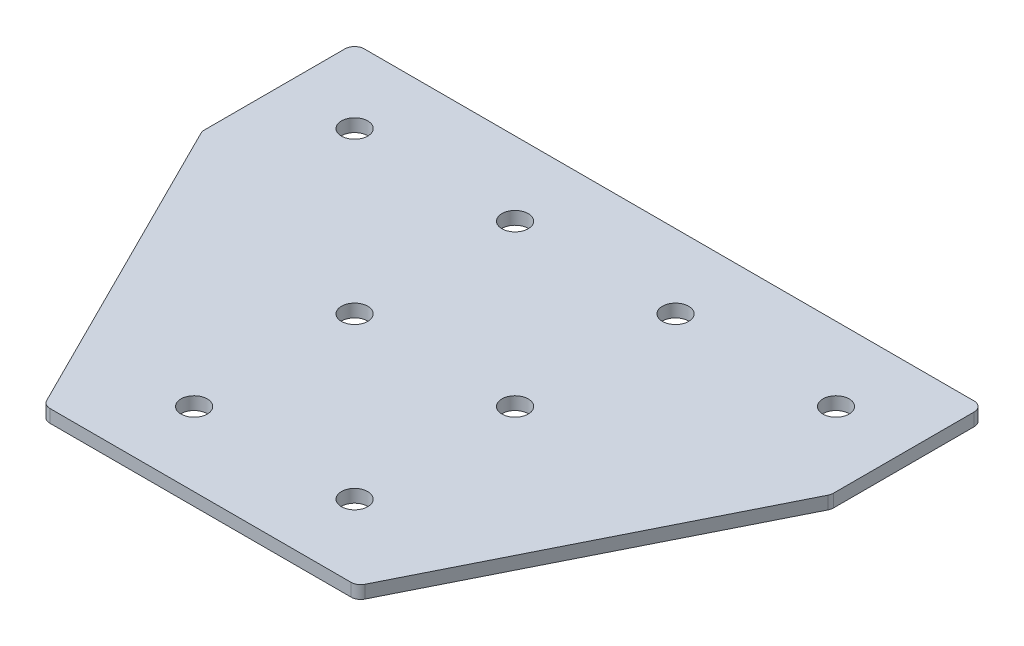
ISO-10303-21;
HEADER;
FILE_DESCRIPTION(('STEP AP214'),'2;1');
FILE_NAME('part.step','',(''),(''),'','','');
FILE_SCHEMA(('AUTOMOTIVE_DESIGN { 1 0 10303 214 1 1 1 1 }'));
ENDSEC;
DATA;
#1=APPLICATION_CONTEXT('core data for automotive mechanical design processes');
#2=APPLICATION_PROTOCOL_DEFINITION('international standard','automotive_design',2000,#1);
#3=PRODUCT_CONTEXT('',#1,'mechanical');
#4=PRODUCT('Part','Part','',(#3));
#5=PRODUCT_RELATED_PRODUCT_CATEGORY('part','',(#4));
#6=PRODUCT_DEFINITION_FORMATION('','',#4);
#7=PRODUCT_DEFINITION_CONTEXT('part definition',#1,'design');
#8=PRODUCT_DEFINITION('design','',#6,#7);
#9=PRODUCT_DEFINITION_SHAPE('','',#8);
#10=(LENGTH_UNIT() NAMED_UNIT(*) SI_UNIT(.MILLI.,.METRE.));
#11=(NAMED_UNIT(*) PLANE_ANGLE_UNIT() SI_UNIT($,.RADIAN.));
#12=(NAMED_UNIT(*) SI_UNIT($,.STERADIAN.) SOLID_ANGLE_UNIT());
#13=UNCERTAINTY_MEASURE_WITH_UNIT(LENGTH_MEASURE(1.E-05),#10,'distance_accuracy_value','');
#14=(GEOMETRIC_REPRESENTATION_CONTEXT(3) GLOBAL_UNCERTAINTY_ASSIGNED_CONTEXT((#13)) GLOBAL_UNIT_ASSIGNED_CONTEXT((#10,
#11,#12)) REPRESENTATION_CONTEXT('',''));
#15=CARTESIAN_POINT('',(0.,0.,0.));
#16=DIRECTION('',(0.,0.,1.));
#17=DIRECTION('',(1.,0.,0.));
#18=AXIS2_PLACEMENT_3D('',#15,#16,#17);
#19=CARTESIAN_POINT('',(-1.20790986693464,-0.158568640349131,-50.6332222330343));
#20=DIRECTION('',(0.,-1.,0.));
#21=DIRECTION('',(0.,0.,-1.));
#22=AXIS2_PLACEMENT_3D('',#19,#20,#21);
#23=PLANE('',#22);
#24=DIRECTION('',(1.,0.,0.));
#25=VECTOR('',#24,1.);
#26=CARTESIAN_POINT('',(-49.2079098669348,-0.158568640349131,72.3667777669657));
#27=LINE('',#26,#25);
#28=CARTESIAN_POINT('',(-48.1177399231852,-0.158568640349131,72.3667777669657));
#29=VERTEX_POINT('',#28);
#30=CARTESIAN_POINT('',(45.701920189316,-0.158568640349131,72.3667777669657));
#31=VERTEX_POINT('',#30);
#32=EDGE_CURVE('E194',#29,#31,#27,.T.);
#33=ORIENTED_EDGE('',*,*,#32,.F.);
#34=CARTESIAN_POINT('',(-48.1177399231852,-0.158568640349131,69.3667777669657));
#35=DIRECTION('',(0.,1.,0.));
#36=DIRECTION('',(0.,0.,-1.));
#37=AXIS2_PLACEMENT_3D('',#34,#35,#36);
#38=CIRCLE('',#37,3.);
#39=CARTESIAN_POINT('',(-50.801021496185,-0.158568640349131,70.7084185534656));
#40=VERTEX_POINT('',#39);
#41=EDGE_CURVE('E154',#40,#29,#38,.T.);
#42=ORIENTED_EDGE('',*,*,#41,.F.);
#43=DIRECTION('',(-0.447213595499957,0.,-0.894427190999917));
#44=VECTOR('',#43,1.);
#45=CARTESIAN_POINT('',(-49.9718418894349,-0.158568640349131,72.3667777669657));
#46=LINE('',#45,#44);
#47=CARTESIAN_POINT('',(-98.8911914399342,-0.158568640349131,-25.4719213340333));
#48=VERTEX_POINT('',#47);
#49=EDGE_CURVE('E141',#40,#48,#46,.T.);
#50=ORIENTED_EDGE('',*,*,#49,.T.);
#51=CARTESIAN_POINT('',(-96.2079098669345,-0.158568640349131,-26.8135621205331));
#52=DIRECTION('',(0.,1.,0.));
#53=DIRECTION('',(0.,0.,-1.));
#54=AXIS2_PLACEMENT_3D('',#51,#52,#53);
#55=CIRCLE('',#54,3.);
#56=CARTESIAN_POINT('',(-99.2079098669345,-0.158568640349131,-26.8135621205331));
#57=VERTEX_POINT('',#56);
#58=EDGE_CURVE('E152',#57,#48,#55,.T.);
#59=ORIENTED_EDGE('',*,*,#58,.F.);
#60=DIRECTION('',(0.,0.,-1.));
#61=VECTOR('',#60,1.);
#62=CARTESIAN_POINT('',(-99.2079098669345,-0.158568640349131,-26.1053581880338));
#63=LINE('',#62,#61);
#64=CARTESIAN_POINT('',(-99.2079098669345,-0.158568640349131,-70.6332222330343));
#65=VERTEX_POINT('',#64);
#66=EDGE_CURVE('E124',#57,#65,#63,.T.);
#67=ORIENTED_EDGE('',*,*,#66,.T.);
#68=CARTESIAN_POINT('',(-96.2079098669345,-0.158568640349131,-70.6332222330343));
#69=DIRECTION('',(0.,1.,0.));
#70=DIRECTION('',(0.,0.,-1.));
#71=AXIS2_PLACEMENT_3D('',#68,#69,#70);
#72=CIRCLE('',#71,3.);
#73=CARTESIAN_POINT('',(-96.2079098669345,-0.158568640349131,-73.6332222330343));
#74=VERTEX_POINT('',#73);
#75=EDGE_CURVE('E149',#74,#65,#72,.T.);
#76=ORIENTED_EDGE('',*,*,#75,.F.);
#77=DIRECTION('',(-1.,0.,0.));
#78=VECTOR('',#77,1.);
#79=CARTESIAN_POINT('',(96.7920901330652,-0.158568640349131,-73.6332222330343));
#80=LINE('',#79,#78);
#81=CARTESIAN_POINT('',(93.7920901330652,-0.158568640349131,-73.6332222330343));
#82=VERTEX_POINT('',#81);
#83=EDGE_CURVE('E191',#82,#74,#80,.T.);
#84=ORIENTED_EDGE('',*,*,#83,.F.);
#85=CARTESIAN_POINT('',(93.7920901330652,-0.158568640349131,-70.6332222330343));
#86=DIRECTION('',(0.,-1.,0.));
#87=DIRECTION('',(0.,0.,-1.));
#88=AXIS2_PLACEMENT_3D('',#85,#86,#87);
#89=CIRCLE('',#88,3.);
#90=CARTESIAN_POINT('',(96.7920901330652,-0.158568640349131,-70.6332222330343));
#91=VERTEX_POINT('',#90);
#92=EDGE_CURVE('E215',#82,#91,#89,.T.);
#93=ORIENTED_EDGE('',*,*,#92,.T.);
#94=DIRECTION('',(0.,0.,-1.));
#95=VECTOR('',#94,1.);
#96=CARTESIAN_POINT('',(96.7920901330652,-0.158568640349131,-26.1053581880338));
#97=LINE('',#96,#95);
#98=CARTESIAN_POINT('',(96.7920901330652,-0.158568640349131,-26.8135621205332));
#99=VERTEX_POINT('',#98);
#100=EDGE_CURVE('E188',#99,#91,#97,.T.);
#101=ORIENTED_EDGE('',*,*,#100,.F.);
#102=CARTESIAN_POINT('',(93.7920901330652,-0.158568640349131,-26.8135621205332));
#103=DIRECTION('',(0.,-1.,0.));
#104=DIRECTION('',(0.,0.,-1.));
#105=AXIS2_PLACEMENT_3D('',#102,#103,#104);
#106=CIRCLE('',#105,3.);
#107=CARTESIAN_POINT('',(96.475371706065,-0.158568640349131,-25.4719213340333));
#108=VERTEX_POINT('',#107);
#109=EDGE_CURVE('E31',#99,#108,#106,.T.);
#110=ORIENTED_EDGE('',*,*,#109,.T.);
#111=DIRECTION('',(0.447213595499956,0.,-0.894427190999917));
#112=VECTOR('',#111,1.);
#113=CARTESIAN_POINT('',(47.5560221555657,-0.158568640349131,72.3667777669657));
#114=LINE('',#113,#112);
#115=CARTESIAN_POINT('',(48.3852017623158,-0.158568640349131,70.7084185534656));
#116=VERTEX_POINT('',#115);
#117=EDGE_CURVE('E196',#116,#108,#114,.T.);
#118=ORIENTED_EDGE('',*,*,#117,.F.);
#119=CARTESIAN_POINT('',(45.701920189316,-0.158568640349131,69.3667777669657));
#120=DIRECTION('',(0.,-1.,0.));
#121=DIRECTION('',(0.,0.,-1.));
#122=AXIS2_PLACEMENT_3D('',#119,#120,#121);
#123=CIRCLE('',#122,3.);
#124=EDGE_CURVE('E218',#116,#31,#123,.T.);
#125=ORIENTED_EDGE('',*,*,#124,.T.);
#126=EDGE_LOOP('',(#33,#42,#50,#59,#67,#76,#84,#93,#101,#110,#118,#125));
#127=FACE_BOUND('',#126,.T.);
#128=CARTESIAN_POINT('',(23.7920901330654,-0.158568640349131,49.3667777669658));
#129=DIRECTION('',(0.,1.,0.));
#130=DIRECTION('',(0.,0.,1.));
#131=AXIS2_PLACEMENT_3D('',#128,#129,#130);
#132=CIRCLE('',#131,4.10000000000001);
#133=CARTESIAN_POINT('',(23.7920901330654,-0.158568640349131,53.4667777669658));
#134=VERTEX_POINT('',#133);
#135=EDGE_CURVE('E164',#134,#134,#132,.T.);
#136=ORIENTED_EDGE('',*,*,#135,.T.);
#137=EDGE_LOOP('',(#136));
#138=FACE_BOUND('',#137,.T.);
#139=CARTESIAN_POINT('',(23.7920901330654,-0.158568640349131,-0.633222233034254));
#140=DIRECTION('',(0.,1.,0.));
#141=DIRECTION('',(0.,0.,1.));
#142=AXIS2_PLACEMENT_3D('',#139,#140,#141);
#143=CIRCLE('',#142,4.1);
#144=CARTESIAN_POINT('',(23.7920901330654,-0.158568640349131,3.46677776696575));
#145=VERTEX_POINT('',#144);
#146=EDGE_CURVE('E170',#145,#145,#143,.T.);
#147=ORIENTED_EDGE('',*,*,#146,.T.);
#148=EDGE_LOOP('',(#147));
#149=FACE_BOUND('',#148,.T.);
#150=CARTESIAN_POINT('',(73.7920901330654,-0.158568640349131,-50.6332222330343));
#151=DIRECTION('',(0.,1.,0.));
#152=DIRECTION('',(0.,0.,1.));
#153=AXIS2_PLACEMENT_3D('',#150,#151,#152);
#154=CIRCLE('',#153,4.09999999999999);
#155=CARTESIAN_POINT('',(73.7920901330654,-0.158568640349131,-46.5332222330343));
#156=VERTEX_POINT('',#155);
#157=EDGE_CURVE('E176',#156,#156,#154,.T.);
#158=ORIENTED_EDGE('',*,*,#157,.T.);
#159=EDGE_LOOP('',(#158));
#160=FACE_BOUND('',#159,.T.);
#161=CARTESIAN_POINT('',(23.7920901330654,-0.158568640349131,-50.6332222330343));
#162=DIRECTION('',(0.,1.,0.));
#163=DIRECTION('',(0.,0.,1.));
#164=AXIS2_PLACEMENT_3D('',#161,#162,#163);
#165=CIRCLE('',#164,4.1);
#166=CARTESIAN_POINT('',(23.7920901330654,-0.158568640349131,-46.5332222330343));
#167=VERTEX_POINT('',#166);
#168=EDGE_CURVE('E182',#167,#167,#165,.T.);
#169=ORIENTED_EDGE('',*,*,#168,.T.);
#170=EDGE_LOOP('',(#169));
#171=FACE_BOUND('',#170,.T.);
#172=CARTESIAN_POINT('',(-26.2079098669346,-0.158568640349131,49.3667777669658));
#173=DIRECTION('',(0.,-1.,0.));
#174=DIRECTION('',(0.,0.,1.));
#175=AXIS2_PLACEMENT_3D('',#172,#173,#174);
#176=CIRCLE('',#175,4.10000000000001);
#177=CARTESIAN_POINT('',(-26.2079098669346,-0.158568640349131,53.4667777669658));
#178=VERTEX_POINT('',#177);
#179=EDGE_CURVE('E270',#178,#178,#176,.T.);
#180=ORIENTED_EDGE('',*,*,#179,.F.);
#181=EDGE_LOOP('',(#180));
#182=FACE_BOUND('',#181,.T.);
#183=CARTESIAN_POINT('',(-26.2079098669346,-0.158568640349131,-0.633222233034247));
#184=DIRECTION('',(0.,-1.,0.));
#185=DIRECTION('',(0.,0.,1.));
#186=AXIS2_PLACEMENT_3D('',#183,#184,#185);
#187=CIRCLE('',#186,4.1);
#188=CARTESIAN_POINT('',(-26.2079098669346,-0.158568640349131,3.46677776696575));
#189=VERTEX_POINT('',#188);
#190=EDGE_CURVE('E264',#189,#189,#187,.T.);
#191=ORIENTED_EDGE('',*,*,#190,.F.);
#192=EDGE_LOOP('',(#191));
#193=FACE_BOUND('',#192,.T.);
#194=CARTESIAN_POINT('',(-76.2079098669347,-0.158568640349131,-50.6332222330342));
#195=DIRECTION('',(0.,-1.,0.));
#196=DIRECTION('',(0.,0.,1.));
#197=AXIS2_PLACEMENT_3D('',#194,#195,#196);
#198=CIRCLE('',#197,4.09999999999999);
#199=CARTESIAN_POINT('',(-76.2079098669347,-0.158568640349131,-46.5332222330343));
#200=VERTEX_POINT('',#199);
#201=EDGE_CURVE('E259',#200,#200,#198,.T.);
#202=ORIENTED_EDGE('',*,*,#201,.F.);
#203=EDGE_LOOP('',(#202));
#204=FACE_BOUND('',#203,.T.);
#205=CARTESIAN_POINT('',(-26.2079098669347,-0.158568640349131,-50.6332222330343));
#206=DIRECTION('',(0.,-1.,0.));
#207=DIRECTION('',(0.,0.,1.));
#208=AXIS2_PLACEMENT_3D('',#205,#206,#207);
#209=CIRCLE('',#208,4.1);
#210=CARTESIAN_POINT('',(-26.2079098669347,-0.158568640349131,-46.5332222330343));
#211=VERTEX_POINT('',#210);
#212=EDGE_CURVE('E134',#211,#211,#209,.T.);
#213=ORIENTED_EDGE('',*,*,#212,.F.);
#214=EDGE_LOOP('',(#213));
#215=FACE_BOUND('',#214,.T.);
#216=ADVANCED_FACE('F16',(#127,#138,#149,#160,#171,#182,#193,#204,#215),#23,.T.);
#217=CARTESIAN_POINT('',(96.7920901330652,-0.158568640349131,-26.1053581880338));
#218=DIRECTION('',(1.,0.,0.));
#219=DIRECTION('',(0.,0.,-1.));
#220=AXIS2_PLACEMENT_3D('',#217,#218,#219);
#221=PLANE('',#220);
#222=DIRECTION('',(0.,0.,-1.));
#223=VECTOR('',#222,1.);
#224=CARTESIAN_POINT('',(96.7920901330652,3.84143135965087,-26.1053581880338));
#225=LINE('',#224,#223);
#226=CARTESIAN_POINT('',(96.7920901330652,3.84143135965087,-26.8135621205332));
#227=VERTEX_POINT('',#226);
#228=CARTESIAN_POINT('',(96.7920901330652,3.84143135965087,-70.6332222330343));
#229=VERTEX_POINT('',#228);
#230=EDGE_CURVE('E185',#227,#229,#225,.T.);
#231=ORIENTED_EDGE('',*,*,#230,.F.);
#232=DIRECTION('',(0.,1.,0.));
#233=VECTOR('',#232,1.);
#234=CARTESIAN_POINT('',(96.7920901330652,-0.158568640349131,-26.8135621205332));
#235=LINE('',#234,#233);
#236=EDGE_CURVE('E24',#227,#99,#235,.F.);
#237=ORIENTED_EDGE('',*,*,#236,.T.);
#238=ORIENTED_EDGE('',*,*,#100,.T.);
#239=DIRECTION('',(0.,1.,0.));
#240=VECTOR('',#239,1.);
#241=CARTESIAN_POINT('',(96.7920901330652,-0.158568640349131,-70.6332222330343));
#242=LINE('',#241,#240);
#243=EDGE_CURVE('E225',#91,#229,#242,.T.);
#244=ORIENTED_EDGE('',*,*,#243,.T.);
#245=EDGE_LOOP('',(#231,#237,#238,#244));
#246=FACE_BOUND('',#245,.T.);
#247=ADVANCED_FACE('F230',(#246),#221,.T.);
#248=CARTESIAN_POINT('',(47.5560221555657,-0.158568640349131,72.3667777669657));
#249=DIRECTION('',(0.894427190999917,0.,0.447213595499956));
#250=DIRECTION('',(0.447213595499956,0.,-0.894427190999917));
#251=AXIS2_PLACEMENT_3D('',#248,#249,#250);
#252=PLANE('',#251);
#253=DIRECTION('',(0.447213595499956,0.,-0.894427190999917));
#254=VECTOR('',#253,1.);
#255=CARTESIAN_POINT('',(47.5560221555657,3.84143135965087,72.3667777669657));
#256=LINE('',#255,#254);
#257=CARTESIAN_POINT('',(48.3852017623158,3.84143135965087,70.7084185534656));
#258=VERTEX_POINT('',#257);
#259=CARTESIAN_POINT('',(96.475371706065,3.84143135965087,-25.4719213340333));
#260=VERTEX_POINT('',#259);
#261=EDGE_CURVE('E192',#258,#260,#256,.T.);
#262=ORIENTED_EDGE('',*,*,#261,.F.);
#263=DIRECTION('',(0.,1.,0.));
#264=VECTOR('',#263,1.);
#265=CARTESIAN_POINT('',(48.3852017623158,-0.158568640349131,70.7084185534656));
#266=LINE('',#265,#264);
#267=EDGE_CURVE('E38',#258,#116,#266,.F.);
#268=ORIENTED_EDGE('',*,*,#267,.T.);
#269=ORIENTED_EDGE('',*,*,#117,.T.);
#270=DIRECTION('',(0.,1.,0.));
#271=VECTOR('',#270,1.);
#272=CARTESIAN_POINT('',(96.475371706065,-0.158568640349131,-25.4719213340333));
#273=LINE('',#272,#271);
#274=EDGE_CURVE('E221',#108,#260,#273,.T.);
#275=ORIENTED_EDGE('',*,*,#274,.T.);
#276=EDGE_LOOP('',(#262,#268,#269,#275));
#277=FACE_BOUND('',#276,.T.);
#278=ADVANCED_FACE('F238',(#277),#252,.T.);
#279=CARTESIAN_POINT('',(-49.2079098669348,-0.158568640349131,72.3667777669657));
#280=DIRECTION('',(0.,0.,1.));
#281=DIRECTION('',(1.,0.,0.));
#282=AXIS2_PLACEMENT_3D('',#279,#280,#281);
#283=PLANE('',#282);
#284=DIRECTION('',(1.,0.,0.));
#285=VECTOR('',#284,1.);
#286=CARTESIAN_POINT('',(-49.2079098669348,3.84143135965087,72.3667777669657));
#287=LINE('',#286,#285);
#288=CARTESIAN_POINT('',(-48.1177399231852,3.84143135965087,72.3667777669657));
#289=VERTEX_POINT('',#288);
#290=CARTESIAN_POINT('',(45.701920189316,3.84143135965087,72.3667777669657));
#291=VERTEX_POINT('',#290);
#292=EDGE_CURVE('E203',#289,#291,#287,.T.);
#293=ORIENTED_EDGE('',*,*,#292,.F.);
#294=DIRECTION('',(0.,1.,0.));
#295=VECTOR('',#294,1.);
#296=CARTESIAN_POINT('',(-48.1177399231852,-0.158568640349131,72.3667777669657));
#297=LINE('',#296,#295);
#298=EDGE_CURVE('E146',#29,#289,#297,.T.);
#299=ORIENTED_EDGE('',*,*,#298,.F.);
#300=ORIENTED_EDGE('',*,*,#32,.T.);
#301=DIRECTION('',(0.,1.,0.));
#302=VECTOR('',#301,1.);
#303=CARTESIAN_POINT('',(45.701920189316,-0.158568640349131,72.3667777669657));
#304=LINE('',#303,#302);
#305=EDGE_CURVE('E212',#31,#291,#304,.T.);
#306=ORIENTED_EDGE('',*,*,#305,.T.);
#307=EDGE_LOOP('',(#293,#299,#300,#306));
#308=FACE_BOUND('',#307,.T.);
#309=ADVANCED_FACE('F246',(#308),#283,.T.);
#310=CARTESIAN_POINT('',(96.7920901330652,-0.158568640349131,-73.6332222330343));
#311=DIRECTION('',(0.,0.,-1.));
#312=DIRECTION('',(-1.,0.,0.));
#313=AXIS2_PLACEMENT_3D('',#310,#311,#312);
#314=PLANE('',#313);
#315=ORIENTED_EDGE('',*,*,#83,.T.);
#316=DIRECTION('',(0.,1.,0.));
#317=VECTOR('',#316,1.);
#318=CARTESIAN_POINT('',(-96.2079098669345,-0.158568640349131,-73.6332222330343));
#319=LINE('',#318,#317);
#320=CARTESIAN_POINT('',(-96.2079098669345,3.84143135965087,-73.6332222330343));
#321=VERTEX_POINT('',#320);
#322=EDGE_CURVE('E126',#321,#74,#319,.F.);
#323=ORIENTED_EDGE('',*,*,#322,.F.);
#324=DIRECTION('',(-1.,0.,0.));
#325=VECTOR('',#324,1.);
#326=CARTESIAN_POINT('',(96.7920901330652,3.84143135965087,-73.6332222330343));
#327=LINE('',#326,#325);
#328=CARTESIAN_POINT('',(93.7920901330652,3.84143135965087,-73.6332222330343));
#329=VERTEX_POINT('',#328);
#330=EDGE_CURVE('E201',#329,#321,#327,.T.);
#331=ORIENTED_EDGE('',*,*,#330,.F.);
#332=DIRECTION('',(0.,1.,0.));
#333=VECTOR('',#332,1.);
#334=CARTESIAN_POINT('',(93.7920901330652,-0.158568640349131,-73.6332222330343));
#335=LINE('',#334,#333);
#336=EDGE_CURVE('E10',#329,#82,#335,.F.);
#337=ORIENTED_EDGE('',*,*,#336,.T.);
#338=EDGE_LOOP('',(#315,#323,#331,#337));
#339=FACE_BOUND('',#338,.T.);
#340=ADVANCED_FACE('F300',(#339),#314,.T.);
#341=CARTESIAN_POINT('',(-1.20790986693464,3.84143135965087,-50.6332222330343));
#342=DIRECTION('',(0.,-1.,0.));
#343=DIRECTION('',(0.,0.,-1.));
#344=AXIS2_PLACEMENT_3D('',#341,#342,#343);
#345=PLANE('',#344);
#346=CARTESIAN_POINT('',(23.7920901330654,3.84143135965087,49.3667777669658));
#347=DIRECTION('',(0.,1.,0.));
#348=DIRECTION('',(0.,0.,1.));
#349=AXIS2_PLACEMENT_3D('',#346,#347,#348);
#350=CIRCLE('',#349,4.10000000000001);
#351=CARTESIAN_POINT('',(23.7920901330654,3.84143135965087,53.4667777669658));
#352=VERTEX_POINT('',#351);
#353=EDGE_CURVE('E163',#352,#352,#350,.T.);
#354=ORIENTED_EDGE('',*,*,#353,.F.);
#355=EDGE_LOOP('',(#354));
#356=FACE_BOUND('',#355,.T.);
#357=CARTESIAN_POINT('',(23.7920901330654,3.84143135965087,-0.633222233034254));
#358=DIRECTION('',(0.,1.,0.));
#359=DIRECTION('',(0.,0.,1.));
#360=AXIS2_PLACEMENT_3D('',#357,#358,#359);
#361=CIRCLE('',#360,4.1);
#362=CARTESIAN_POINT('',(23.7920901330654,3.84143135965087,3.46677776696575));
#363=VERTEX_POINT('',#362);
#364=EDGE_CURVE('E167',#363,#363,#361,.T.);
#365=ORIENTED_EDGE('',*,*,#364,.F.);
#366=EDGE_LOOP('',(#365));
#367=FACE_BOUND('',#366,.T.);
#368=CARTESIAN_POINT('',(73.7920901330654,3.84143135965087,-50.6332222330343));
#369=DIRECTION('',(0.,1.,0.));
#370=DIRECTION('',(0.,0.,1.));
#371=AXIS2_PLACEMENT_3D('',#368,#369,#370);
#372=CIRCLE('',#371,4.09999999999999);
#373=CARTESIAN_POINT('',(73.7920901330654,3.84143135965087,-46.5332222330343));
#374=VERTEX_POINT('',#373);
#375=EDGE_CURVE('E173',#374,#374,#372,.T.);
#376=ORIENTED_EDGE('',*,*,#375,.F.);
#377=EDGE_LOOP('',(#376));
#378=FACE_BOUND('',#377,.T.);
#379=CARTESIAN_POINT('',(23.7920901330654,3.84143135965087,-50.6332222330343));
#380=DIRECTION('',(0.,1.,0.));
#381=DIRECTION('',(0.,0.,1.));
#382=AXIS2_PLACEMENT_3D('',#379,#380,#381);
#383=CIRCLE('',#382,4.1);
#384=CARTESIAN_POINT('',(23.7920901330654,3.84143135965087,-46.5332222330343));
#385=VERTEX_POINT('',#384);
#386=EDGE_CURVE('E179',#385,#385,#383,.T.);
#387=ORIENTED_EDGE('',*,*,#386,.F.);
#388=EDGE_LOOP('',(#387));
#389=FACE_BOUND('',#388,.T.);
#390=ORIENTED_EDGE('',*,*,#330,.T.);
#391=CARTESIAN_POINT('',(-96.2079098669345,3.84143135965087,-70.6332222330343));
#392=DIRECTION('',(0.,1.,0.));
#393=DIRECTION('',(0.,0.,-1.));
#394=AXIS2_PLACEMENT_3D('',#391,#392,#393);
#395=CIRCLE('',#394,3.);
#396=CARTESIAN_POINT('',(-99.2079098669345,3.84143135965087,-70.6332222330343));
#397=VERTEX_POINT('',#396);
#398=EDGE_CURVE('E117',#397,#321,#395,.F.);
#399=ORIENTED_EDGE('',*,*,#398,.F.);
#400=DIRECTION('',(0.,0.,-1.));
#401=VECTOR('',#400,1.);
#402=CARTESIAN_POINT('',(-99.2079098669345,3.84143135965087,-26.1053581880338));
#403=LINE('',#402,#401);
#404=CARTESIAN_POINT('',(-99.2079098669345,3.84143135965087,-26.8135621205331));
#405=VERTEX_POINT('',#404);
#406=EDGE_CURVE('E122',#405,#397,#403,.T.);
#407=ORIENTED_EDGE('',*,*,#406,.F.);
#408=CARTESIAN_POINT('',(-96.2079098669345,3.84143135965087,-26.8135621205331));
#409=DIRECTION('',(0.,1.,0.));
#410=DIRECTION('',(0.,0.,-1.));
#411=AXIS2_PLACEMENT_3D('',#408,#409,#410);
#412=CIRCLE('',#411,3.);
#413=CARTESIAN_POINT('',(-98.8911914399342,3.84143135965087,-25.4719213340333));
#414=VERTEX_POINT('',#413);
#415=EDGE_CURVE('E105',#414,#405,#412,.F.);
#416=ORIENTED_EDGE('',*,*,#415,.F.);
#417=DIRECTION('',(-0.447213595499957,0.,-0.894427190999917));
#418=VECTOR('',#417,1.);
#419=CARTESIAN_POINT('',(-49.9718418894349,3.84143135965087,72.3667777669657));
#420=LINE('',#419,#418);
#421=CARTESIAN_POINT('',(-50.801021496185,3.84143135965087,70.7084185534656));
#422=VERTEX_POINT('',#421);
#423=EDGE_CURVE('E133',#422,#414,#420,.T.);
#424=ORIENTED_EDGE('',*,*,#423,.F.);
#425=CARTESIAN_POINT('',(-48.1177399231852,3.84143135965087,69.3667777669657));
#426=DIRECTION('',(0.,1.,0.));
#427=DIRECTION('',(0.,0.,-1.));
#428=AXIS2_PLACEMENT_3D('',#425,#426,#427);
#429=CIRCLE('',#428,3.);
#430=EDGE_CURVE('E116',#289,#422,#429,.F.);
#431=ORIENTED_EDGE('',*,*,#430,.F.);
#432=ORIENTED_EDGE('',*,*,#292,.T.);
#433=CARTESIAN_POINT('',(45.701920189316,3.84143135965087,69.3667777669657));
#434=DIRECTION('',(0.,-1.,0.));
#435=DIRECTION('',(0.,0.,-1.));
#436=AXIS2_PLACEMENT_3D('',#433,#434,#435);
#437=CIRCLE('',#436,3.);
#438=EDGE_CURVE('E210',#291,#258,#437,.F.);
#439=ORIENTED_EDGE('',*,*,#438,.T.);
#440=ORIENTED_EDGE('',*,*,#261,.T.);
#441=CARTESIAN_POINT('',(93.7920901330652,3.84143135965087,-26.8135621205332));
#442=DIRECTION('',(0.,-1.,0.));
#443=DIRECTION('',(0.,0.,-1.));
#444=AXIS2_PLACEMENT_3D('',#441,#442,#443);
#445=CIRCLE('',#444,3.);
#446=EDGE_CURVE('E208',#260,#227,#445,.F.);
#447=ORIENTED_EDGE('',*,*,#446,.T.);
#448=ORIENTED_EDGE('',*,*,#230,.T.);
#449=CARTESIAN_POINT('',(93.7920901330652,3.84143135965087,-70.6332222330343));
#450=DIRECTION('',(0.,-1.,0.));
#451=DIRECTION('',(0.,0.,-1.));
#452=AXIS2_PLACEMENT_3D('',#449,#450,#451);
#453=CIRCLE('',#452,3.);
#454=EDGE_CURVE('E198',#229,#329,#453,.F.);
#455=ORIENTED_EDGE('',*,*,#454,.T.);
#456=EDGE_LOOP('',(#390,#399,#407,#416,#424,#431,#432,#439,#440,#447,#448,#455));
#457=FACE_BOUND('',#456,.T.);
#458=CARTESIAN_POINT('',(-26.2079098669346,3.84143135965087,49.3667777669658));
#459=DIRECTION('',(0.,-1.,0.));
#460=DIRECTION('',(0.,0.,1.));
#461=AXIS2_PLACEMENT_3D('',#458,#459,#460);
#462=CIRCLE('',#461,4.10000000000001);
#463=CARTESIAN_POINT('',(-26.2079098669346,3.84143135965087,53.4667777669658));
#464=VERTEX_POINT('',#463);
#465=EDGE_CURVE('E273',#464,#464,#462,.T.);
#466=ORIENTED_EDGE('',*,*,#465,.T.);
#467=EDGE_LOOP('',(#466));
#468=FACE_BOUND('',#467,.T.);
#469=CARTESIAN_POINT('',(-26.2079098669346,3.84143135965087,-0.633222233034247));
#470=DIRECTION('',(0.,-1.,0.));
#471=DIRECTION('',(0.,0.,1.));
#472=AXIS2_PLACEMENT_3D('',#469,#470,#471);
#473=CIRCLE('',#472,4.1);
#474=CARTESIAN_POINT('',(-26.2079098669346,3.84143135965087,3.46677776696575));
#475=VERTEX_POINT('',#474);
#476=EDGE_CURVE('E267',#475,#475,#473,.T.);
#477=ORIENTED_EDGE('',*,*,#476,.T.);
#478=EDGE_LOOP('',(#477));
#479=FACE_BOUND('',#478,.T.);
#480=CARTESIAN_POINT('',(-76.2079098669347,3.84143135965087,-50.6332222330342));
#481=DIRECTION('',(0.,-1.,0.));
#482=DIRECTION('',(0.,0.,1.));
#483=AXIS2_PLACEMENT_3D('',#480,#481,#482);
#484=CIRCLE('',#483,4.09999999999999);
#485=CARTESIAN_POINT('',(-76.2079098669347,3.84143135965087,-46.5332222330343));
#486=VERTEX_POINT('',#485);
#487=EDGE_CURVE('E261',#486,#486,#484,.T.);
#488=ORIENTED_EDGE('',*,*,#487,.T.);
#489=EDGE_LOOP('',(#488));
#490=FACE_BOUND('',#489,.T.);
#491=CARTESIAN_POINT('',(-26.2079098669347,3.84143135965087,-50.6332222330343));
#492=DIRECTION('',(0.,-1.,0.));
#493=DIRECTION('',(0.,0.,1.));
#494=AXIS2_PLACEMENT_3D('',#491,#492,#493);
#495=CIRCLE('',#494,4.1);
#496=CARTESIAN_POINT('',(-26.2079098669347,3.84143135965087,-46.5332222330343));
#497=VERTEX_POINT('',#496);
#498=EDGE_CURVE('E138',#497,#497,#495,.T.);
#499=ORIENTED_EDGE('',*,*,#498,.T.);
#500=EDGE_LOOP('',(#499));
#501=FACE_BOUND('',#500,.T.);
#502=ADVANCED_FACE('F129',(#356,#367,#378,#389,#457,#468,#479,#490,#501),#345,.F.);
#503=CARTESIAN_POINT('',(45.701920189316,-0.158568640349131,69.3667777669657));
#504=DIRECTION('',(0.,1.,0.));
#505=DIRECTION('',(0.,0.,1.));
#506=AXIS2_PLACEMENT_3D('',#503,#504,#505);
#507=CYLINDRICAL_SURFACE('',#506,3.);
#508=ORIENTED_EDGE('',*,*,#124,.F.);
#509=ORIENTED_EDGE('',*,*,#267,.F.);
#510=ORIENTED_EDGE('',*,*,#438,.F.);
#511=ORIENTED_EDGE('',*,*,#305,.F.);
#512=EDGE_LOOP('',(#508,#509,#510,#511));
#513=FACE_BOUND('',#512,.T.);
#514=ADVANCED_FACE('F244',(#513),#507,.T.);
#515=CARTESIAN_POINT('',(93.7920901330652,-0.158568640349131,-26.8135621205332));
#516=DIRECTION('',(0.,1.,0.));
#517=DIRECTION('',(0.,0.,1.));
#518=AXIS2_PLACEMENT_3D('',#515,#516,#517);
#519=CYLINDRICAL_SURFACE('',#518,3.);
#520=ORIENTED_EDGE('',*,*,#109,.F.);
#521=ORIENTED_EDGE('',*,*,#236,.F.);
#522=ORIENTED_EDGE('',*,*,#446,.F.);
#523=ORIENTED_EDGE('',*,*,#274,.F.);
#524=EDGE_LOOP('',(#520,#521,#522,#523));
#525=FACE_BOUND('',#524,.T.);
#526=ADVANCED_FACE('F237',(#525),#519,.T.);
#527=CARTESIAN_POINT('',(93.7920901330652,-0.158568640349131,-70.6332222330343));
#528=DIRECTION('',(0.,1.,0.));
#529=DIRECTION('',(0.,0.,1.));
#530=AXIS2_PLACEMENT_3D('',#527,#528,#529);
#531=CYLINDRICAL_SURFACE('',#530,3.);
#532=ORIENTED_EDGE('',*,*,#92,.F.);
#533=ORIENTED_EDGE('',*,*,#336,.F.);
#534=ORIENTED_EDGE('',*,*,#454,.F.);
#535=ORIENTED_EDGE('',*,*,#243,.F.);
#536=EDGE_LOOP('',(#532,#533,#534,#535));
#537=FACE_BOUND('',#536,.T.);
#538=ADVANCED_FACE('F18',(#537),#531,.T.);
#539=CARTESIAN_POINT('',(23.7920901330654,-0.158568640349131,-50.6332222330343));
#540=DIRECTION('',(0.,1.,0.));
#541=DIRECTION('',(0.,0.,1.));
#542=AXIS2_PLACEMENT_3D('',#539,#540,#541);
#543=CYLINDRICAL_SURFACE('',#542,4.1);
#544=ORIENTED_EDGE('',*,*,#168,.F.);
#545=EDGE_LOOP('',(#544));
#546=FACE_BOUND('',#545,.T.);
#547=ORIENTED_EDGE('',*,*,#386,.T.);
#548=EDGE_LOOP('',(#547));
#549=FACE_BOUND('',#548,.T.);
#550=ADVANCED_FACE('F318',(#546,#549),#543,.F.);
#551=CARTESIAN_POINT('',(73.7920901330654,-0.158568640349131,-50.6332222330343));
#552=DIRECTION('',(0.,1.,0.));
#553=DIRECTION('',(0.,0.,1.));
#554=AXIS2_PLACEMENT_3D('',#551,#552,#553);
#555=CYLINDRICAL_SURFACE('',#554,4.09999999999999);
#556=ORIENTED_EDGE('',*,*,#157,.F.);
#557=EDGE_LOOP('',(#556));
#558=FACE_BOUND('',#557,.T.);
#559=ORIENTED_EDGE('',*,*,#375,.T.);
#560=EDGE_LOOP('',(#559));
#561=FACE_BOUND('',#560,.T.);
#562=ADVANCED_FACE('F323',(#558,#561),#555,.F.);
#563=CARTESIAN_POINT('',(23.7920901330654,-0.158568640349131,-0.633222233034254));
#564=DIRECTION('',(0.,1.,0.));
#565=DIRECTION('',(0.,0.,1.));
#566=AXIS2_PLACEMENT_3D('',#563,#564,#565);
#567=CYLINDRICAL_SURFACE('',#566,4.1);
#568=ORIENTED_EDGE('',*,*,#146,.F.);
#569=EDGE_LOOP('',(#568));
#570=FACE_BOUND('',#569,.T.);
#571=ORIENTED_EDGE('',*,*,#364,.T.);
#572=EDGE_LOOP('',(#571));
#573=FACE_BOUND('',#572,.T.);
#574=ADVANCED_FACE('F341',(#570,#573),#567,.F.);
#575=CARTESIAN_POINT('',(23.7920901330654,-0.158568640349131,49.3667777669658));
#576=DIRECTION('',(0.,1.,0.));
#577=DIRECTION('',(0.,0.,1.));
#578=AXIS2_PLACEMENT_3D('',#575,#576,#577);
#579=CYLINDRICAL_SURFACE('',#578,4.10000000000001);
#580=ORIENTED_EDGE('',*,*,#135,.F.);
#581=EDGE_LOOP('',(#580));
#582=FACE_BOUND('',#581,.T.);
#583=ORIENTED_EDGE('',*,*,#353,.T.);
#584=EDGE_LOOP('',(#583));
#585=FACE_BOUND('',#584,.T.);
#586=ADVANCED_FACE('F338',(#582,#585),#579,.F.);
#587=CARTESIAN_POINT('',(-99.2079098669345,-0.158568640349131,-26.1053581880338));
#588=DIRECTION('',(-1.,0.,0.));
#589=DIRECTION('',(0.,0.,-1.));
#590=AXIS2_PLACEMENT_3D('',#587,#588,#589);
#591=PLANE('',#590);
#592=ORIENTED_EDGE('',*,*,#406,.T.);
#593=DIRECTION('',(0.,1.,0.));
#594=VECTOR('',#593,1.);
#595=CARTESIAN_POINT('',(-99.2079098669345,-0.158568640349131,-70.6332222330343));
#596=LINE('',#595,#594);
#597=EDGE_CURVE('E127',#65,#397,#596,.T.);
#598=ORIENTED_EDGE('',*,*,#597,.F.);
#599=ORIENTED_EDGE('',*,*,#66,.F.);
#600=DIRECTION('',(0.,1.,0.));
#601=VECTOR('',#600,1.);
#602=CARTESIAN_POINT('',(-99.2079098669345,-0.158568640349131,-26.8135621205331));
#603=LINE('',#602,#601);
#604=EDGE_CURVE('E109',#405,#57,#603,.F.);
#605=ORIENTED_EDGE('',*,*,#604,.F.);
#606=EDGE_LOOP('',(#592,#598,#599,#605));
#607=FACE_BOUND('',#606,.T.);
#608=ADVANCED_FACE('F121',(#607),#591,.T.);
#609=CARTESIAN_POINT('',(-49.9718418894349,-0.158568640349131,72.3667777669657));
#610=DIRECTION('',(-0.894427190999917,0.,0.447213595499957));
#611=DIRECTION('',(-0.447213595499957,0.,-0.894427190999917));
#612=AXIS2_PLACEMENT_3D('',#609,#610,#611);
#613=PLANE('',#612);
#614=ORIENTED_EDGE('',*,*,#423,.T.);
#615=DIRECTION('',(0.,1.,0.));
#616=VECTOR('',#615,1.);
#617=CARTESIAN_POINT('',(-98.8911914399342,-0.158568640349131,-25.4719213340333));
#618=LINE('',#617,#616);
#619=EDGE_CURVE('E111',#48,#414,#618,.T.);
#620=ORIENTED_EDGE('',*,*,#619,.F.);
#621=ORIENTED_EDGE('',*,*,#49,.F.);
#622=DIRECTION('',(0.,1.,0.));
#623=VECTOR('',#622,1.);
#624=CARTESIAN_POINT('',(-50.801021496185,-0.158568640349131,70.7084185534656));
#625=LINE('',#624,#623);
#626=EDGE_CURVE('E158',#422,#40,#625,.F.);
#627=ORIENTED_EDGE('',*,*,#626,.F.);
#628=EDGE_LOOP('',(#614,#620,#621,#627));
#629=FACE_BOUND('',#628,.T.);
#630=ADVANCED_FACE('F255',(#629),#613,.T.);
#631=CARTESIAN_POINT('',(-48.1177399231852,-0.158568640349131,69.3667777669657));
#632=DIRECTION('',(0.,1.,0.));
#633=DIRECTION('',(0.,0.,1.));
#634=AXIS2_PLACEMENT_3D('',#631,#632,#633);
#635=CYLINDRICAL_SURFACE('',#634,3.);
#636=ORIENTED_EDGE('',*,*,#41,.T.);
#637=ORIENTED_EDGE('',*,*,#298,.T.);
#638=ORIENTED_EDGE('',*,*,#430,.T.);
#639=ORIENTED_EDGE('',*,*,#626,.T.);
#640=EDGE_LOOP('',(#636,#637,#638,#639));
#641=FACE_BOUND('',#640,.T.);
#642=ADVANCED_FACE('F252',(#641),#635,.T.);
#643=CARTESIAN_POINT('',(-96.2079098669345,-0.158568640349131,-26.8135621205331));
#644=DIRECTION('',(0.,1.,0.));
#645=DIRECTION('',(0.,0.,1.));
#646=AXIS2_PLACEMENT_3D('',#643,#644,#645);
#647=CYLINDRICAL_SURFACE('',#646,3.);
#648=ORIENTED_EDGE('',*,*,#58,.T.);
#649=ORIENTED_EDGE('',*,*,#619,.T.);
#650=ORIENTED_EDGE('',*,*,#415,.T.);
#651=ORIENTED_EDGE('',*,*,#604,.T.);
#652=EDGE_LOOP('',(#648,#649,#650,#651));
#653=FACE_BOUND('',#652,.T.);
#654=ADVANCED_FACE('F108',(#653),#647,.T.);
#655=CARTESIAN_POINT('',(-96.2079098669345,-0.158568640349131,-70.6332222330343));
#656=DIRECTION('',(0.,1.,0.));
#657=DIRECTION('',(0.,0.,1.));
#658=AXIS2_PLACEMENT_3D('',#655,#656,#657);
#659=CYLINDRICAL_SURFACE('',#658,3.);
#660=ORIENTED_EDGE('',*,*,#75,.T.);
#661=ORIENTED_EDGE('',*,*,#597,.T.);
#662=ORIENTED_EDGE('',*,*,#398,.T.);
#663=ORIENTED_EDGE('',*,*,#322,.T.);
#664=EDGE_LOOP('',(#660,#661,#662,#663));
#665=FACE_BOUND('',#664,.T.);
#666=ADVANCED_FACE('F295',(#665),#659,.T.);
#667=CARTESIAN_POINT('',(-26.2079098669347,-0.158568640349131,-50.6332222330343));
#668=DIRECTION('',(0.,1.,0.));
#669=DIRECTION('',(0.,0.,1.));
#670=AXIS2_PLACEMENT_3D('',#667,#668,#669);
#671=CYLINDRICAL_SURFACE('',#670,4.1);
#672=ORIENTED_EDGE('',*,*,#212,.T.);
#673=EDGE_LOOP('',(#672));
#674=FACE_BOUND('',#673,.T.);
#675=ORIENTED_EDGE('',*,*,#498,.F.);
#676=EDGE_LOOP('',(#675));
#677=FACE_BOUND('',#676,.T.);
#678=ADVANCED_FACE('F291',(#674,#677),#671,.F.);
#679=CARTESIAN_POINT('',(-76.2079098669347,-0.158568640349131,-50.6332222330342));
#680=DIRECTION('',(0.,1.,0.));
#681=DIRECTION('',(0.,0.,1.));
#682=AXIS2_PLACEMENT_3D('',#679,#680,#681);
#683=CYLINDRICAL_SURFACE('',#682,4.09999999999999);
#684=ORIENTED_EDGE('',*,*,#201,.T.);
#685=EDGE_LOOP('',(#684));
#686=FACE_BOUND('',#685,.T.);
#687=ORIENTED_EDGE('',*,*,#487,.F.);
#688=EDGE_LOOP('',(#687));
#689=FACE_BOUND('',#688,.T.);
#690=ADVANCED_FACE('F294',(#686,#689),#683,.F.);
#691=CARTESIAN_POINT('',(-26.2079098669346,-0.158568640349131,-0.633222233034247));
#692=DIRECTION('',(0.,1.,0.));
#693=DIRECTION('',(0.,0.,1.));
#694=AXIS2_PLACEMENT_3D('',#691,#692,#693);
#695=CYLINDRICAL_SURFACE('',#694,4.1);
#696=ORIENTED_EDGE('',*,*,#190,.T.);
#697=EDGE_LOOP('',(#696));
#698=FACE_BOUND('',#697,.T.);
#699=ORIENTED_EDGE('',*,*,#476,.F.);
#700=EDGE_LOOP('',(#699));
#701=FACE_BOUND('',#700,.T.);
#702=ADVANCED_FACE('F456',(#698,#701),#695,.F.);
#703=CARTESIAN_POINT('',(-26.2079098669346,-0.158568640349131,49.3667777669658));
#704=DIRECTION('',(0.,1.,0.));
#705=DIRECTION('',(0.,0.,1.));
#706=AXIS2_PLACEMENT_3D('',#703,#704,#705);
#707=CYLINDRICAL_SURFACE('',#706,4.10000000000001);
#708=ORIENTED_EDGE('',*,*,#179,.T.);
#709=EDGE_LOOP('',(#708));
#710=FACE_BOUND('',#709,.T.);
#711=ORIENTED_EDGE('',*,*,#465,.F.);
#712=EDGE_LOOP('',(#711));
#713=FACE_BOUND('',#712,.T.);
#714=ADVANCED_FACE('F279',(#710,#713),#707,.F.);
#715=CLOSED_SHELL('',(#216,#247,#278,#309,#340,#502,#514,#526,#538,#550,#562,#574,#586,#608,
#630,#642,#654,#666,#678,#690,#702,#714));
#716=MANIFOLD_SOLID_BREP('B1',#715);
#717=ADVANCED_BREP_SHAPE_REPRESENTATION('',(#18,#716),#14);
#718=SHAPE_DEFINITION_REPRESENTATION(#9,#717);
ENDSEC;
END-ISO-10303-21;
